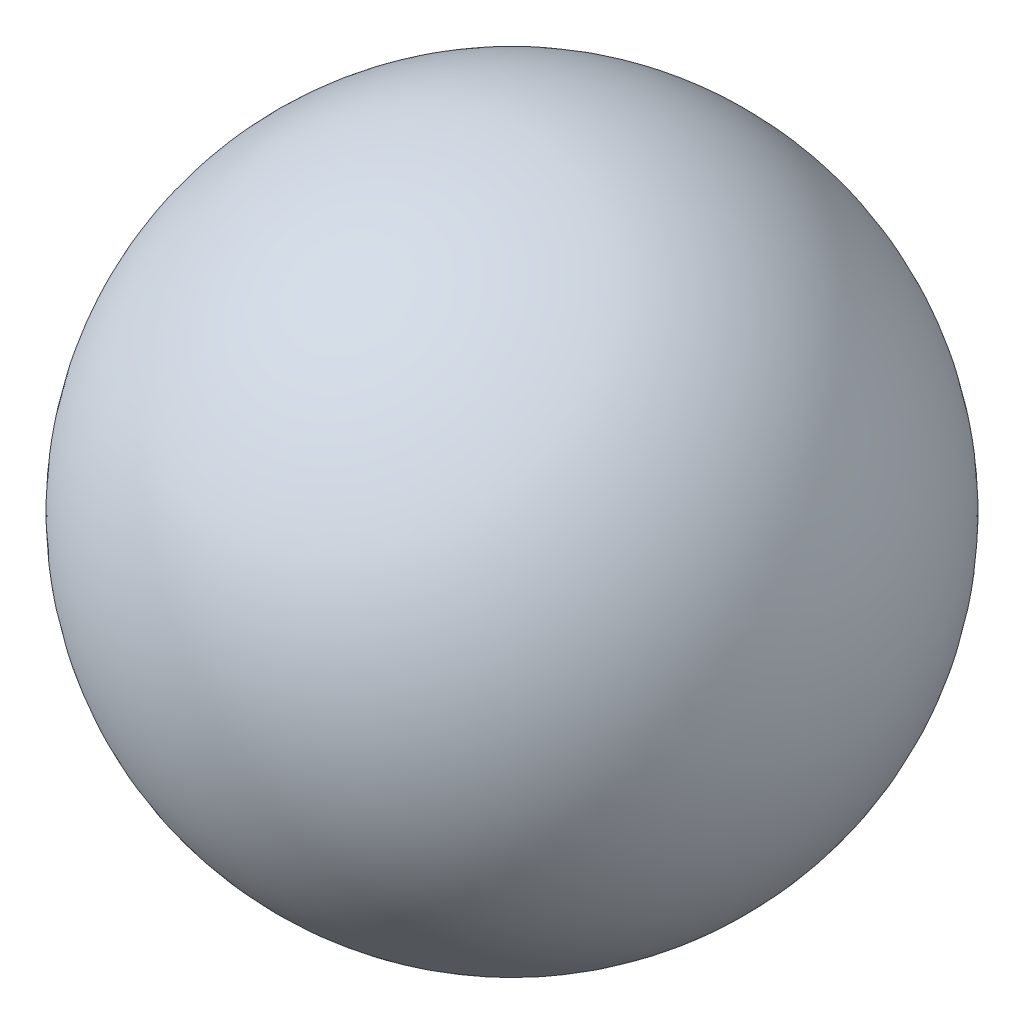
ISO-10303-21;
HEADER;
FILE_DESCRIPTION(('STEP AP214'),'2;1');
FILE_NAME('part.step','',(''),(''),'','','');
FILE_SCHEMA(('AUTOMOTIVE_DESIGN { 1 0 10303 214 1 1 1 1 }'));
ENDSEC;
DATA;
#1=APPLICATION_CONTEXT('core data for automotive mechanical design processes');
#2=APPLICATION_PROTOCOL_DEFINITION('international standard','automotive_design',2000,#1);
#3=PRODUCT_CONTEXT('',#1,'mechanical');
#4=PRODUCT('Part','Part','',(#3));
#5=PRODUCT_RELATED_PRODUCT_CATEGORY('part','',(#4));
#6=PRODUCT_DEFINITION_FORMATION('','',#4);
#7=PRODUCT_DEFINITION_CONTEXT('part definition',#1,'design');
#8=PRODUCT_DEFINITION('design','',#6,#7);
#9=PRODUCT_DEFINITION_SHAPE('','',#8);
#10=(LENGTH_UNIT() NAMED_UNIT(*) SI_UNIT(.MILLI.,.METRE.));
#11=(NAMED_UNIT(*) PLANE_ANGLE_UNIT() SI_UNIT($,.RADIAN.));
#12=(NAMED_UNIT(*) SI_UNIT($,.STERADIAN.) SOLID_ANGLE_UNIT());
#13=UNCERTAINTY_MEASURE_WITH_UNIT(LENGTH_MEASURE(1.E-05),#10,'distance_accuracy_value','');
#14=(GEOMETRIC_REPRESENTATION_CONTEXT(3) GLOBAL_UNCERTAINTY_ASSIGNED_CONTEXT((#13)) GLOBAL_UNIT_ASSIGNED_CONTEXT((#10,
#11,#12)) REPRESENTATION_CONTEXT('',''));
#15=CARTESIAN_POINT('',(0.,0.,0.));
#16=DIRECTION('',(0.,0.,1.));
#17=DIRECTION('',(1.,0.,0.));
#18=AXIS2_PLACEMENT_3D('',#15,#16,#17);
#19=CARTESIAN_POINT('',(0.162216309159763,0.,0.));
#20=DIRECTION('',(0.,0.,-1.));
#21=DIRECTION('',(1.,0.,0.));
#22=AXIS2_PLACEMENT_3D('',#19,#20,#21);
#23=CIRCLE('',#22,76.2001726647057);
#24=TRIMMED_CURVE('',#23,(PARAMETER_VALUE(-1.5729251465339)),(PARAMETER_VALUE(1.5729251465339)),
.T.,.PARAMETER.);
#25=CARTESIAN_POINT('',(0.,0.,0.));
#26=DIRECTION('',(0.,-1.,0.));
#27=AXIS1_PLACEMENT('',#25,#26);
#28=SURFACE_OF_REVOLUTION('',#24,#27);
#29=CARTESIAN_POINT('',(0.,-76.2,0.));
#30=VERTEX_POINT('',#29);
#31=VERTEX_LOOP('',#30);
#32=FACE_BOUND('',#31,.T.);
#33=CARTESIAN_POINT('',(0.,76.2,0.));
#34=VERTEX_POINT('',#33);
#35=VERTEX_LOOP('',#34);
#36=FACE_BOUND('',#35,.T.);
#37=ADVANCED_FACE('F34',(#32,#36),#28,.T.);
#38=CLOSED_SHELL('',(#37));
#39=MANIFOLD_SOLID_BREP('B2',#38);
#40=ADVANCED_BREP_SHAPE_REPRESENTATION('',(#18,#39),#14);
#41=SHAPE_DEFINITION_REPRESENTATION(#9,#40);
ENDSEC;
END-ISO-10303-21;
